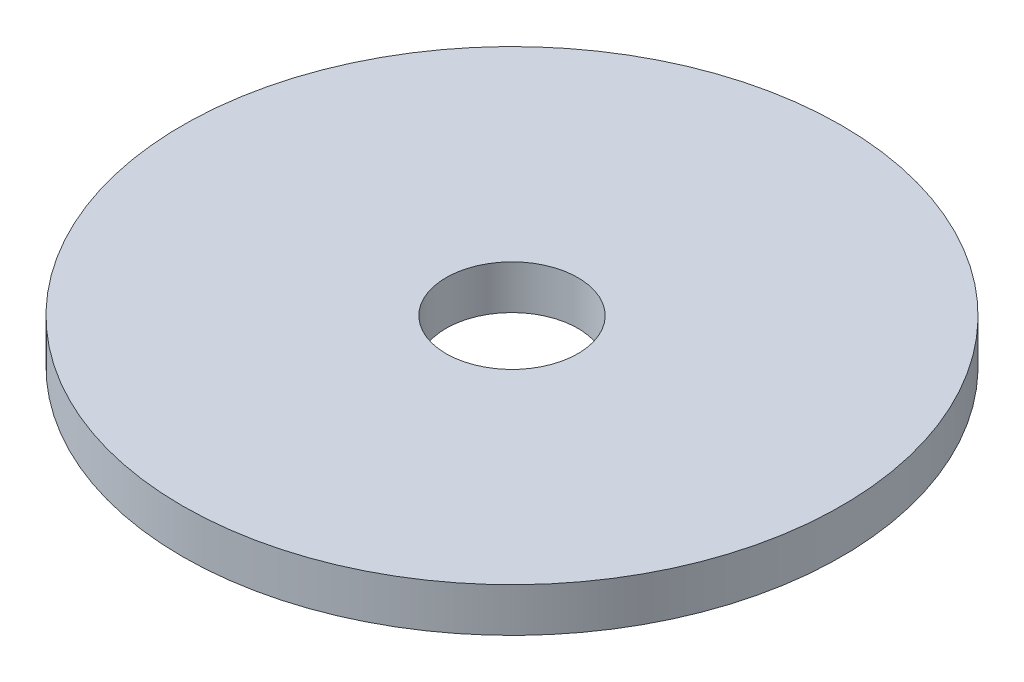
ISO-10303-21;
HEADER;
FILE_DESCRIPTION(('STEP AP214'),'2;1');
FILE_NAME('part.step','',(''),(''),'','','');
FILE_SCHEMA(('AUTOMOTIVE_DESIGN { 1 0 10303 214 1 1 1 1 }'));
ENDSEC;
DATA;
#1=APPLICATION_CONTEXT('core data for automotive mechanical design processes');
#2=APPLICATION_PROTOCOL_DEFINITION('international standard','automotive_design',2000,#1);
#3=PRODUCT_CONTEXT('',#1,'mechanical');
#4=PRODUCT('Part','Part','',(#3));
#5=PRODUCT_RELATED_PRODUCT_CATEGORY('part','',(#4));
#6=PRODUCT_DEFINITION_FORMATION('','',#4);
#7=PRODUCT_DEFINITION_CONTEXT('part definition',#1,'design');
#8=PRODUCT_DEFINITION('design','',#6,#7);
#9=PRODUCT_DEFINITION_SHAPE('','',#8);
#10=(LENGTH_UNIT() NAMED_UNIT(*) SI_UNIT(.MILLI.,.METRE.));
#11=(NAMED_UNIT(*) PLANE_ANGLE_UNIT() SI_UNIT($,.RADIAN.));
#12=(NAMED_UNIT(*) SI_UNIT($,.STERADIAN.) SOLID_ANGLE_UNIT());
#13=UNCERTAINTY_MEASURE_WITH_UNIT(LENGTH_MEASURE(1.E-05),#10,'distance_accuracy_value','');
#14=(GEOMETRIC_REPRESENTATION_CONTEXT(3) GLOBAL_UNCERTAINTY_ASSIGNED_CONTEXT((#13)) GLOBAL_UNIT_ASSIGNED_CONTEXT((#10,
#11,#12)) REPRESENTATION_CONTEXT('',''));
#15=CARTESIAN_POINT('',(0.,0.,0.));
#16=DIRECTION('',(0.,0.,1.));
#17=DIRECTION('',(1.,0.,0.));
#18=AXIS2_PLACEMENT_3D('',#15,#16,#17);
#19=CARTESIAN_POINT('',(0.,2.,0.));
#20=DIRECTION('',(0.,-1.,0.));
#21=DIRECTION('',(0.,0.,-1.));
#22=AXIS2_PLACEMENT_3D('',#19,#20,#21);
#23=CYLINDRICAL_SURFACE('',#22,15.);
#24=CARTESIAN_POINT('',(0.,2.,0.));
#25=DIRECTION('',(0.,1.,0.));
#26=DIRECTION('',(0.,0.,1.));
#27=AXIS2_PLACEMENT_3D('',#24,#25,#26);
#28=CIRCLE('',#27,15.);
#29=CARTESIAN_POINT('',(0.,2.,15.));
#30=VERTEX_POINT('',#29);
#31=EDGE_CURVE('E10',#30,#30,#28,.T.);
#32=ORIENTED_EDGE('',*,*,#31,.F.);
#33=EDGE_LOOP('',(#32));
#34=FACE_BOUND('',#33,.T.);
#35=CARTESIAN_POINT('',(0.,0.,0.));
#36=DIRECTION('',(0.,1.,0.));
#37=DIRECTION('',(0.,0.,1.));
#38=AXIS2_PLACEMENT_3D('',#35,#36,#37);
#39=CIRCLE('',#38,15.);
#40=CARTESIAN_POINT('',(0.,0.,15.));
#41=VERTEX_POINT('',#40);
#42=EDGE_CURVE('E42',#41,#41,#39,.T.);
#43=ORIENTED_EDGE('',*,*,#42,.T.);
#44=EDGE_LOOP('',(#43));
#45=FACE_BOUND('',#44,.T.);
#46=ADVANCED_FACE('F35',(#34,#45),#23,.T.);
#47=CARTESIAN_POINT('',(0.,2.,0.));
#48=DIRECTION('',(0.,1.,0.));
#49=DIRECTION('',(0.,0.,1.));
#50=AXIS2_PLACEMENT_3D('',#47,#48,#49);
#51=PLANE('',#50);
#52=CARTESIAN_POINT('',(0.,2.,0.));
#53=DIRECTION('',(0.,1.,0.));
#54=DIRECTION('',(0.,0.,1.));
#55=AXIS2_PLACEMENT_3D('',#52,#53,#54);
#56=CIRCLE('',#55,3.);
#57=CARTESIAN_POINT('',(0.,2.,2.99999999999999));
#58=VERTEX_POINT('',#57);
#59=EDGE_CURVE('E48',#58,#58,#56,.T.);
#60=ORIENTED_EDGE('',*,*,#59,.F.);
#61=EDGE_LOOP('',(#60));
#62=FACE_BOUND('',#61,.T.);
#63=ORIENTED_EDGE('',*,*,#31,.T.);
#64=EDGE_LOOP('',(#63));
#65=FACE_BOUND('',#64,.T.);
#66=ADVANCED_FACE('F64',(#62,#65),#51,.T.);
#67=CARTESIAN_POINT('',(0.,0.,0.));
#68=DIRECTION('',(0.,1.,0.));
#69=DIRECTION('',(0.,0.,1.));
#70=AXIS2_PLACEMENT_3D('',#67,#68,#69);
#71=PLANE('',#70);
#72=CARTESIAN_POINT('',(0.,0.,0.));
#73=DIRECTION('',(0.,1.,0.));
#74=DIRECTION('',(0.,0.,1.));
#75=AXIS2_PLACEMENT_3D('',#72,#73,#74);
#76=CIRCLE('',#75,3.);
#77=CARTESIAN_POINT('',(0.,0.,2.99999999999999));
#78=VERTEX_POINT('',#77);
#79=EDGE_CURVE('E38',#78,#78,#76,.T.);
#80=ORIENTED_EDGE('',*,*,#79,.T.);
#81=EDGE_LOOP('',(#80));
#82=FACE_BOUND('',#81,.T.);
#83=ORIENTED_EDGE('',*,*,#42,.F.);
#84=EDGE_LOOP('',(#83));
#85=FACE_BOUND('',#84,.T.);
#86=ADVANCED_FACE('F55',(#82,#85),#71,.F.);
#87=CARTESIAN_POINT('',(0.,-8.,0.));
#88=DIRECTION('',(0.,1.,0.));
#89=DIRECTION('',(0.,0.,1.));
#90=AXIS2_PLACEMENT_3D('',#87,#88,#89);
#91=CYLINDRICAL_SURFACE('',#90,3.);
#92=ORIENTED_EDGE('',*,*,#59,.T.);
#93=EDGE_LOOP('',(#92));
#94=FACE_BOUND('',#93,.T.);
#95=ORIENTED_EDGE('',*,*,#79,.F.);
#96=EDGE_LOOP('',(#95));
#97=FACE_BOUND('',#96,.T.);
#98=ADVANCED_FACE('F58',(#94,#97),#91,.F.);
#99=CLOSED_SHELL('',(#46,#66,#86,#98));
#100=MANIFOLD_SOLID_BREP('B2',#99);
#101=ADVANCED_BREP_SHAPE_REPRESENTATION('',(#18,#100),#14);
#102=SHAPE_DEFINITION_REPRESENTATION(#9,#101);
ENDSEC;
END-ISO-10303-21;
